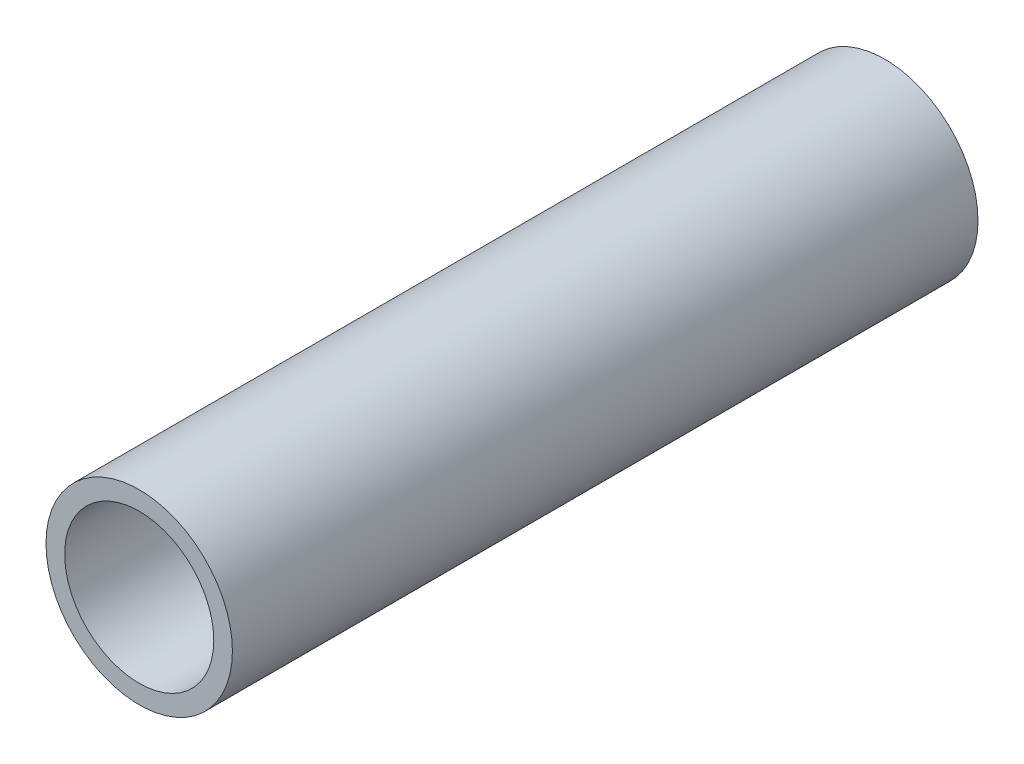
ISO-10303-21;
HEADER;
FILE_DESCRIPTION(('STEP AP214'),'2;1');
FILE_NAME('part.step','',(''),(''),'','','');
FILE_SCHEMA(('AUTOMOTIVE_DESIGN { 1 0 10303 214 1 1 1 1 }'));
ENDSEC;
DATA;
#1=APPLICATION_CONTEXT('core data for automotive mechanical design processes');
#2=APPLICATION_PROTOCOL_DEFINITION('international standard','automotive_design',2000,#1);
#3=PRODUCT_CONTEXT('',#1,'mechanical');
#4=PRODUCT('Part','Part','',(#3));
#5=PRODUCT_RELATED_PRODUCT_CATEGORY('part','',(#4));
#6=PRODUCT_DEFINITION_FORMATION('','',#4);
#7=PRODUCT_DEFINITION_CONTEXT('part definition',#1,'design');
#8=PRODUCT_DEFINITION('design','',#6,#7);
#9=PRODUCT_DEFINITION_SHAPE('','',#8);
#10=(LENGTH_UNIT() NAMED_UNIT(*) SI_UNIT(.MILLI.,.METRE.));
#11=(NAMED_UNIT(*) PLANE_ANGLE_UNIT() SI_UNIT($,.RADIAN.));
#12=(NAMED_UNIT(*) SI_UNIT($,.STERADIAN.) SOLID_ANGLE_UNIT());
#13=UNCERTAINTY_MEASURE_WITH_UNIT(LENGTH_MEASURE(1.E-05),#10,'distance_accuracy_value','');
#14=(GEOMETRIC_REPRESENTATION_CONTEXT(3) GLOBAL_UNCERTAINTY_ASSIGNED_CONTEXT((#13)) GLOBAL_UNIT_ASSIGNED_CONTEXT((#10,
#11,#12)) REPRESENTATION_CONTEXT('',''));
#15=CARTESIAN_POINT('',(0.,0.,0.));
#16=DIRECTION('',(0.,0.,1.));
#17=DIRECTION('',(1.,0.,0.));
#18=AXIS2_PLACEMENT_3D('',#15,#16,#17);
#19=CARTESIAN_POINT('',(0.,0.,10.));
#20=DIRECTION('',(0.,0.,1.));
#21=DIRECTION('',(1.,0.,0.));
#22=AXIS2_PLACEMENT_3D('',#19,#20,#21);
#23=PLANE('',#22);
#24=CARTESIAN_POINT('',(0.,0.,10.));
#25=DIRECTION('',(0.,0.,1.));
#26=DIRECTION('',(1.,0.,0.));
#27=AXIS2_PLACEMENT_3D('',#24,#25,#26);
#28=CIRCLE('',#27,1.25);
#29=CARTESIAN_POINT('',(1.25,0.,10.));
#30=VERTEX_POINT('',#29);
#31=EDGE_CURVE('E10',#30,#30,#28,.T.);
#32=ORIENTED_EDGE('',*,*,#31,.T.);
#33=EDGE_LOOP('',(#32));
#34=FACE_BOUND('',#33,.T.);
#35=CARTESIAN_POINT('',(0.,0.,10.));
#36=DIRECTION('',(0.,0.,1.));
#37=DIRECTION('',(1.,0.,0.));
#38=AXIS2_PLACEMENT_3D('',#35,#36,#37);
#39=CIRCLE('',#38,1.);
#40=CARTESIAN_POINT('',(1.,0.,10.));
#41=VERTEX_POINT('',#40);
#42=EDGE_CURVE('E41',#41,#41,#39,.T.);
#43=ORIENTED_EDGE('',*,*,#42,.F.);
#44=EDGE_LOOP('',(#43));
#45=FACE_BOUND('',#44,.T.);
#46=ADVANCED_FACE('F30',(#34,#45),#23,.T.);
#47=CARTESIAN_POINT('',(0.,0.,0.));
#48=DIRECTION('',(0.,0.,1.));
#49=DIRECTION('',(1.,0.,0.));
#50=AXIS2_PLACEMENT_3D('',#47,#48,#49);
#51=PLANE('',#50);
#52=CARTESIAN_POINT('',(0.,0.,0.));
#53=DIRECTION('',(0.,0.,1.));
#54=DIRECTION('',(1.,0.,0.));
#55=AXIS2_PLACEMENT_3D('',#52,#53,#54);
#56=CIRCLE('',#55,1.25);
#57=CARTESIAN_POINT('',(1.25,0.,0.));
#58=VERTEX_POINT('',#57);
#59=EDGE_CURVE('E34',#58,#58,#56,.T.);
#60=ORIENTED_EDGE('',*,*,#59,.F.);
#61=EDGE_LOOP('',(#60));
#62=FACE_BOUND('',#61,.T.);
#63=CARTESIAN_POINT('',(0.,0.,0.));
#64=DIRECTION('',(0.,0.,1.));
#65=DIRECTION('',(1.,0.,0.));
#66=AXIS2_PLACEMENT_3D('',#63,#64,#65);
#67=CIRCLE('',#66,1.);
#68=CARTESIAN_POINT('',(1.,0.,0.));
#69=VERTEX_POINT('',#68);
#70=EDGE_CURVE('E43',#69,#69,#67,.T.);
#71=ORIENTED_EDGE('',*,*,#70,.T.);
#72=EDGE_LOOP('',(#71));
#73=FACE_BOUND('',#72,.T.);
#74=ADVANCED_FACE('F53',(#62,#73),#51,.F.);
#75=CARTESIAN_POINT('',(0.,0.,10.));
#76=DIRECTION('',(0.,0.,-1.));
#77=DIRECTION('',(-1.,0.,0.));
#78=AXIS2_PLACEMENT_3D('',#75,#76,#77);
#79=CYLINDRICAL_SURFACE('',#78,1.25);
#80=ORIENTED_EDGE('',*,*,#31,.F.);
#81=EDGE_LOOP('',(#80));
#82=FACE_BOUND('',#81,.T.);
#83=ORIENTED_EDGE('',*,*,#59,.T.);
#84=EDGE_LOOP('',(#83));
#85=FACE_BOUND('',#84,.T.);
#86=ADVANCED_FACE('F32',(#82,#85),#79,.T.);
#87=CARTESIAN_POINT('',(0.,0.,10.));
#88=DIRECTION('',(0.,0.,-1.));
#89=DIRECTION('',(-1.,0.,0.));
#90=AXIS2_PLACEMENT_3D('',#87,#88,#89);
#91=CYLINDRICAL_SURFACE('',#90,1.);
#92=ORIENTED_EDGE('',*,*,#42,.T.);
#93=EDGE_LOOP('',(#92));
#94=FACE_BOUND('',#93,.T.);
#95=ORIENTED_EDGE('',*,*,#70,.F.);
#96=EDGE_LOOP('',(#95));
#97=FACE_BOUND('',#96,.T.);
#98=ADVANCED_FACE('F49',(#94,#97),#91,.F.);
#99=CLOSED_SHELL('',(#46,#74,#86,#98));
#100=MANIFOLD_SOLID_BREP('B2',#99);
#101=ADVANCED_BREP_SHAPE_REPRESENTATION('',(#18,#100),#14);
#102=SHAPE_DEFINITION_REPRESENTATION(#9,#101);
ENDSEC;
END-ISO-10303-21;
